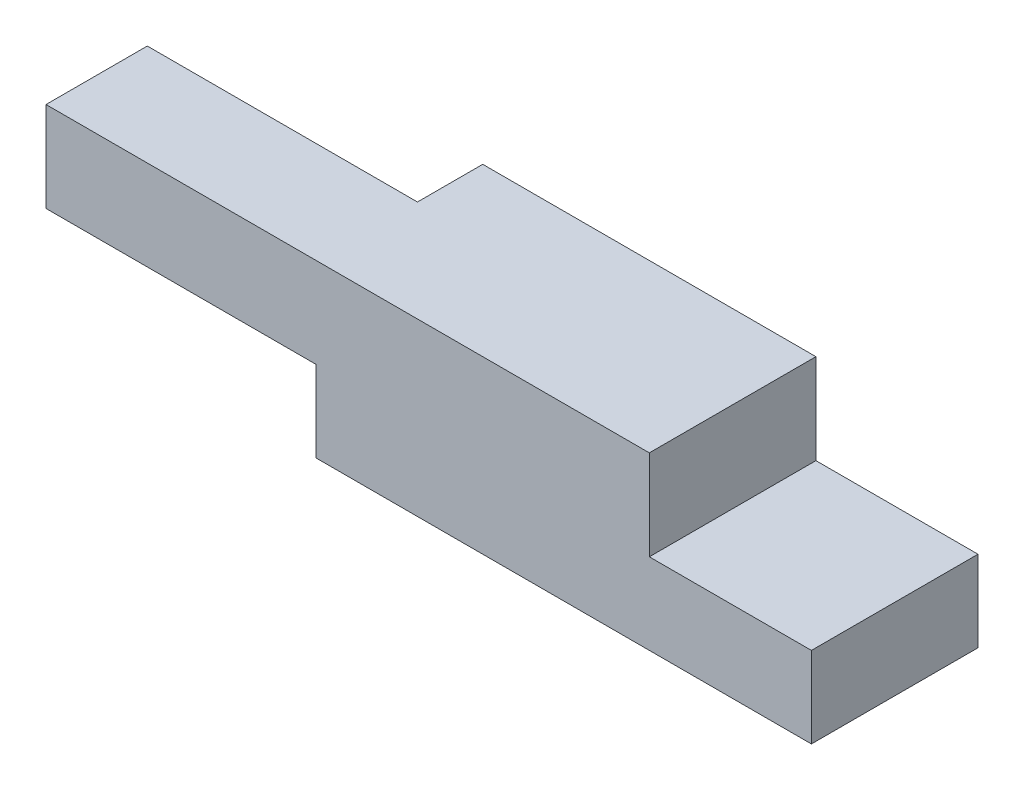
ISO-10303-21;
HEADER;
FILE_DESCRIPTION(('STEP AP214'),'2;1');
FILE_NAME('part.step','',(''),(''),'','','');
FILE_SCHEMA(('AUTOMOTIVE_DESIGN { 1 0 10303 214 1 1 1 1 }'));
ENDSEC;
DATA;
#1=APPLICATION_CONTEXT('core data for automotive mechanical design processes');
#2=APPLICATION_PROTOCOL_DEFINITION('international standard','automotive_design',2000,#1);
#3=PRODUCT_CONTEXT('',#1,'mechanical');
#4=PRODUCT('Part','Part','',(#3));
#5=PRODUCT_RELATED_PRODUCT_CATEGORY('part','',(#4));
#6=PRODUCT_DEFINITION_FORMATION('','',#4);
#7=PRODUCT_DEFINITION_CONTEXT('part definition',#1,'design');
#8=PRODUCT_DEFINITION('design','',#6,#7);
#9=PRODUCT_DEFINITION_SHAPE('','',#8);
#10=(LENGTH_UNIT() NAMED_UNIT(*) SI_UNIT(.MILLI.,.METRE.));
#11=(NAMED_UNIT(*) PLANE_ANGLE_UNIT() SI_UNIT($,.RADIAN.));
#12=(NAMED_UNIT(*) SI_UNIT($,.STERADIAN.) SOLID_ANGLE_UNIT());
#13=UNCERTAINTY_MEASURE_WITH_UNIT(LENGTH_MEASURE(1.E-05),#10,'distance_accuracy_value','');
#14=(GEOMETRIC_REPRESENTATION_CONTEXT(3) GLOBAL_UNCERTAINTY_ASSIGNED_CONTEXT((#13)) GLOBAL_UNIT_ASSIGNED_CONTEXT((#10,
#11,#12)) REPRESENTATION_CONTEXT('',''));
#15=CARTESIAN_POINT('',(0.,0.,0.));
#16=DIRECTION('',(0.,0.,1.));
#17=DIRECTION('',(1.,0.,0.));
#18=AXIS2_PLACEMENT_3D('',#15,#16,#17);
#19=CARTESIAN_POINT('',(-27.5,9.,-9.25));
#20=DIRECTION('',(1.,0.,0.));
#21=DIRECTION('',(0.,0.,-1.));
#22=AXIS2_PLACEMENT_3D('',#19,#20,#21);
#23=PLANE('',#22);
#24=DIRECTION('',(0.,0.,1.));
#25=VECTOR('',#24,1.);
#26=CARTESIAN_POINT('',(-27.5,9.,9.25));
#27=LINE('',#26,#25);
#28=CARTESIAN_POINT('',(-27.5,9.,2.00000000000001));
#29=VERTEX_POINT('',#28);
#30=CARTESIAN_POINT('',(-27.5,9.,9.25));
#31=VERTEX_POINT('',#30);
#32=EDGE_CURVE('E59',#29,#31,#27,.T.);
#33=ORIENTED_EDGE('',*,*,#32,.F.);
#34=DIRECTION('',(0.,1.,0.));
#35=VECTOR('',#34,1.);
#36=CARTESIAN_POINT('',(-27.5,0.,2.00000000000001));
#37=LINE('',#36,#35);
#38=CARTESIAN_POINT('',(-27.5,0.,2.00000000000001));
#39=VERTEX_POINT('',#38);
#40=EDGE_CURVE('E177',#39,#29,#37,.T.);
#41=ORIENTED_EDGE('',*,*,#40,.F.);
#42=DIRECTION('',(0.,0.,1.));
#43=VECTOR('',#42,1.);
#44=CARTESIAN_POINT('',(-27.5,0.,-9.25));
#45=LINE('',#44,#43);
#46=CARTESIAN_POINT('',(-27.5,0.,9.25));
#47=VERTEX_POINT('',#46);
#48=EDGE_CURVE('E239',#39,#47,#45,.T.);
#49=ORIENTED_EDGE('',*,*,#48,.T.);
#50=DIRECTION('',(0.,-1.,0.));
#51=VECTOR('',#50,1.);
#52=CARTESIAN_POINT('',(-27.5,9.,9.25));
#53=LINE('',#52,#51);
#54=EDGE_CURVE('E55',#31,#47,#53,.T.);
#55=ORIENTED_EDGE('',*,*,#54,.F.);
#56=EDGE_LOOP('',(#33,#41,#49,#55));
#57=FACE_BOUND('',#56,.T.);
#58=ADVANCED_FACE('F39',(#57),#23,.F.);
#59=CARTESIAN_POINT('',(-31.5,0.,2.00000000000001));
#60=DIRECTION('',(0.,0.,-1.));
#61=DIRECTION('',(-1.,0.,0.));
#62=AXIS2_PLACEMENT_3D('',#59,#60,#61);
#63=PLANE('',#62);
#64=DIRECTION('',(1.,0.,0.));
#65=VECTOR('',#64,1.);
#66=CARTESIAN_POINT('',(-31.5,9.,2.00000000000001));
#67=LINE('',#66,#65);
#68=CARTESIAN_POINT('',(-31.5,9.,2.00000000000001));
#69=VERTEX_POINT('',#68);
#70=EDGE_CURVE('E173',#69,#29,#67,.T.);
#71=ORIENTED_EDGE('',*,*,#70,.F.);
#72=DIRECTION('',(0.,1.,0.));
#73=VECTOR('',#72,1.);
#74=CARTESIAN_POINT('',(-31.5,0.,2.00000000000001));
#75=LINE('',#74,#73);
#76=CARTESIAN_POINT('',(-31.5,0.,2.00000000000001));
#77=VERTEX_POINT('',#76);
#78=EDGE_CURVE('E178',#77,#69,#75,.T.);
#79=ORIENTED_EDGE('',*,*,#78,.F.);
#80=DIRECTION('',(1.,0.,0.));
#81=VECTOR('',#80,1.);
#82=CARTESIAN_POINT('',(-31.5,0.,2.00000000000001));
#83=LINE('',#82,#81);
#84=EDGE_CURVE('E188',#77,#39,#83,.T.);
#85=ORIENTED_EDGE('',*,*,#84,.T.);
#86=ORIENTED_EDGE('',*,*,#40,.T.);
#87=EDGE_LOOP('',(#71,#79,#85,#86));
#88=FACE_BOUND('',#87,.T.);
#89=ADVANCED_FACE('F284',(#88),#63,.F.);
#90=CARTESIAN_POINT('',(-31.5,0.,0.));
#91=DIRECTION('',(1.,0.,0.));
#92=DIRECTION('',(0.,0.,-1.));
#93=AXIS2_PLACEMENT_3D('',#90,#91,#92);
#94=PLANE('',#93);
#95=DIRECTION('',(0.,0.,1.));
#96=VECTOR('',#95,1.);
#97=CARTESIAN_POINT('',(-31.5,9.,0.));
#98=LINE('',#97,#96);
#99=CARTESIAN_POINT('',(-31.5,9.,-1.99999999999999));
#100=VERTEX_POINT('',#99);
#101=EDGE_CURVE('E11',#100,#69,#98,.T.);
#102=ORIENTED_EDGE('',*,*,#101,.F.);
#103=DIRECTION('',(0.,-1.,0.));
#104=VECTOR('',#103,1.);
#105=CARTESIAN_POINT('',(-31.5,0.,-1.99999999999999));
#106=LINE('',#105,#104);
#107=CARTESIAN_POINT('',(-31.5,0.,-1.99999999999999));
#108=VERTEX_POINT('',#107);
#109=EDGE_CURVE('E181',#100,#108,#106,.T.);
#110=ORIENTED_EDGE('',*,*,#109,.T.);
#111=DIRECTION('',(0.,0.,1.));
#112=VECTOR('',#111,1.);
#113=CARTESIAN_POINT('',(-31.5,0.,-1.99999999999999));
#114=LINE('',#113,#112);
#115=EDGE_CURVE('E185',#108,#77,#114,.T.);
#116=ORIENTED_EDGE('',*,*,#115,.T.);
#117=ORIENTED_EDGE('',*,*,#78,.T.);
#118=EDGE_LOOP('',(#102,#110,#116,#117));
#119=FACE_BOUND('',#118,.T.);
#120=ADVANCED_FACE('F286',(#119),#94,.F.);
#121=DIRECTION('',(0.,-1.,0.));
#122=VECTOR('',#121,1.);
#123=CARTESIAN_POINT('',(-27.5,0.,-1.99999999999999));
#124=LINE('',#123,#122);
#125=CARTESIAN_POINT('',(-27.5,19.,-1.99999999999999));
#126=VERTEX_POINT('',#125);
#127=CARTESIAN_POINT('',(-27.5,0.,-1.99999999999999));
#128=VERTEX_POINT('',#127);
#129=EDGE_CURVE('E182',#126,#128,#124,.T.);
#130=ORIENTED_EDGE('',*,*,#129,.F.);
#131=DIRECTION('',(0.,0.,1.));
#132=VECTOR('',#131,1.);
#133=CARTESIAN_POINT('',(-27.5,19.,-9.25));
#134=LINE('',#133,#132);
#135=CARTESIAN_POINT('',(-27.5,19.,-9.25));
#136=VERTEX_POINT('',#135);
#137=EDGE_CURVE('E140',#136,#126,#134,.T.);
#138=ORIENTED_EDGE('',*,*,#137,.F.);
#139=DIRECTION('',(0.,-1.,0.));
#140=VECTOR('',#139,1.);
#141=CARTESIAN_POINT('',(-27.5,9.,-9.25));
#142=LINE('',#141,#140);
#143=CARTESIAN_POINT('',(-27.5,0.,-9.25));
#144=VERTEX_POINT('',#143);
#145=EDGE_CURVE('E251',#136,#144,#142,.T.);
#146=ORIENTED_EDGE('',*,*,#145,.T.);
#147=EDGE_CURVE('E240',#144,#128,#45,.T.);
#148=ORIENTED_EDGE('',*,*,#147,.T.);
#149=EDGE_LOOP('',(#130,#138,#146,#148));
#150=FACE_BOUND('',#149,.T.);
#151=ADVANCED_FACE('F271',(#150),#23,.F.);
#152=CARTESIAN_POINT('',(27.5,9.,-9.24999999999999));
#153=DIRECTION('',(-1.,0.,0.));
#154=DIRECTION('',(0.,0.,1.));
#155=AXIS2_PLACEMENT_3D('',#152,#153,#154);
#156=PLANE('',#155);
#157=DIRECTION('',(0.,0.,-1.));
#158=VECTOR('',#157,1.);
#159=CARTESIAN_POINT('',(27.5,0.,-9.24999999999999));
#160=LINE('',#159,#158);
#161=CARTESIAN_POINT('',(27.5,0.,9.25));
#162=VERTEX_POINT('',#161);
#163=CARTESIAN_POINT('',(27.5,0.,-9.24999999999999));
#164=VERTEX_POINT('',#163);
#165=EDGE_CURVE('E220',#162,#164,#160,.T.);
#166=ORIENTED_EDGE('',*,*,#165,.T.);
#167=DIRECTION('',(0.,-1.,0.));
#168=VECTOR('',#167,1.);
#169=CARTESIAN_POINT('',(27.5,9.,-9.24999999999999));
#170=LINE('',#169,#168);
#171=CARTESIAN_POINT('',(27.5,9.,-9.24999999999999));
#172=VERTEX_POINT('',#171);
#173=EDGE_CURVE('E48',#172,#164,#170,.T.);
#174=ORIENTED_EDGE('',*,*,#173,.F.);
#175=DIRECTION('',(0.,0.,-1.));
#176=VECTOR('',#175,1.);
#177=CARTESIAN_POINT('',(27.5,9.,-9.24999999999999));
#178=LINE('',#177,#176);
#179=CARTESIAN_POINT('',(27.5,9.,9.25));
#180=VERTEX_POINT('',#179);
#181=EDGE_CURVE('E221',#180,#172,#178,.T.);
#182=ORIENTED_EDGE('',*,*,#181,.F.);
#183=DIRECTION('',(0.,-1.,0.));
#184=VECTOR('',#183,1.);
#185=CARTESIAN_POINT('',(27.5,9.,9.25));
#186=LINE('',#185,#184);
#187=EDGE_CURVE('E232',#180,#162,#186,.T.);
#188=ORIENTED_EDGE('',*,*,#187,.T.);
#189=EDGE_LOOP('',(#166,#174,#182,#188));
#190=FACE_BOUND('',#189,.T.);
#191=ADVANCED_FACE('F41',(#190),#156,.F.);
#192=CARTESIAN_POINT('',(-27.5,9.,-9.25));
#193=DIRECTION('',(0.,0.,1.));
#194=DIRECTION('',(1.,0.,0.));
#195=AXIS2_PLACEMENT_3D('',#192,#193,#194);
#196=PLANE('',#195);
#197=DIRECTION('',(-1.,0.,0.));
#198=VECTOR('',#197,1.);
#199=CARTESIAN_POINT('',(-27.5,0.,-9.25));
#200=LINE('',#199,#198);
#201=EDGE_CURVE('E236',#164,#144,#200,.T.);
#202=ORIENTED_EDGE('',*,*,#201,.T.);
#203=ORIENTED_EDGE('',*,*,#145,.F.);
#204=DIRECTION('',(-1.,0.,0.));
#205=VECTOR('',#204,1.);
#206=CARTESIAN_POINT('',(-27.5,19.,-9.25));
#207=LINE('',#206,#205);
#208=CARTESIAN_POINT('',(9.5,19.,-9.25));
#209=VERTEX_POINT('',#208);
#210=EDGE_CURVE('E207',#209,#136,#207,.T.);
#211=ORIENTED_EDGE('',*,*,#210,.F.);
#212=DIRECTION('',(0.,-1.,0.));
#213=VECTOR('',#212,1.);
#214=CARTESIAN_POINT('',(9.5,19.,-9.25));
#215=LINE('',#214,#213);
#216=CARTESIAN_POINT('',(9.5,9.,-9.25));
#217=VERTEX_POINT('',#216);
#218=EDGE_CURVE('E211',#209,#217,#215,.T.);
#219=ORIENTED_EDGE('',*,*,#218,.T.);
#220=DIRECTION('',(-1.,0.,0.));
#221=VECTOR('',#220,1.);
#222=CARTESIAN_POINT('',(-27.5,9.,-9.25));
#223=LINE('',#222,#221);
#224=EDGE_CURVE('E225',#172,#217,#223,.T.);
#225=ORIENTED_EDGE('',*,*,#224,.F.);
#226=ORIENTED_EDGE('',*,*,#173,.T.);
#227=EDGE_LOOP('',(#202,#203,#211,#219,#225,#226));
#228=FACE_BOUND('',#227,.T.);
#229=ADVANCED_FACE('F258',(#228),#196,.F.);
#230=CARTESIAN_POINT('',(-27.5,9.,9.25));
#231=DIRECTION('',(0.,0.,-1.));
#232=DIRECTION('',(-1.,0.,0.));
#233=AXIS2_PLACEMENT_3D('',#230,#231,#232);
#234=PLANE('',#233);
#235=DIRECTION('',(1.,0.,0.));
#236=VECTOR('',#235,1.);
#237=CARTESIAN_POINT('',(-27.5,0.,9.25));
#238=LINE('',#237,#236);
#239=EDGE_CURVE('E226',#47,#162,#238,.T.);
#240=ORIENTED_EDGE('',*,*,#239,.T.);
#241=ORIENTED_EDGE('',*,*,#187,.F.);
#242=DIRECTION('',(1.,0.,0.));
#243=VECTOR('',#242,1.);
#244=CARTESIAN_POINT('',(-27.5,9.,9.25));
#245=LINE('',#244,#243);
#246=CARTESIAN_POINT('',(9.5,9.,9.25));
#247=VERTEX_POINT('',#246);
#248=EDGE_CURVE('E229',#247,#180,#245,.T.);
#249=ORIENTED_EDGE('',*,*,#248,.F.);
#250=DIRECTION('',(0.,-1.,0.));
#251=VECTOR('',#250,1.);
#252=CARTESIAN_POINT('',(9.5,19.,9.25));
#253=LINE('',#252,#251);
#254=CARTESIAN_POINT('',(9.5,19.,9.25));
#255=VERTEX_POINT('',#254);
#256=EDGE_CURVE('E135',#255,#247,#253,.T.);
#257=ORIENTED_EDGE('',*,*,#256,.F.);
#258=DIRECTION('',(1.,0.,0.));
#259=VECTOR('',#258,1.);
#260=CARTESIAN_POINT('',(-27.5,19.,9.25));
#261=LINE('',#260,#259);
#262=CARTESIAN_POINT('',(-57.5,19.,9.25000000000001));
#263=VERTEX_POINT('',#262);
#264=EDGE_CURVE('E127',#263,#255,#261,.T.);
#265=ORIENTED_EDGE('',*,*,#264,.F.);
#266=DIRECTION('',(0.,1.,0.));
#267=VECTOR('',#266,1.);
#268=CARTESIAN_POINT('',(-57.5,19.,9.25000000000001));
#269=LINE('',#268,#267);
#270=CARTESIAN_POINT('',(-57.5,9.,9.25000000000001));
#271=VERTEX_POINT('',#270);
#272=EDGE_CURVE('E132',#271,#263,#269,.T.);
#273=ORIENTED_EDGE('',*,*,#272,.F.);
#274=DIRECTION('',(1.,0.,0.));
#275=VECTOR('',#274,1.);
#276=CARTESIAN_POINT('',(-57.5,9.,9.25000000000001));
#277=LINE('',#276,#275);
#278=EDGE_CURVE('E165',#271,#31,#277,.T.);
#279=ORIENTED_EDGE('',*,*,#278,.T.);
#280=ORIENTED_EDGE('',*,*,#54,.T.);
#281=EDGE_LOOP('',(#240,#241,#249,#257,#265,#273,#279,#280));
#282=FACE_BOUND('',#281,.T.);
#283=ADVANCED_FACE('F129',(#282),#234,.F.);
#284=CARTESIAN_POINT('',(0.,9.,0.));
#285=DIRECTION('',(0.,1.,0.));
#286=DIRECTION('',(0.,0.,1.));
#287=AXIS2_PLACEMENT_3D('',#284,#285,#286);
#288=PLANE('',#287);
#289=DIRECTION('',(0.,0.,-1.));
#290=VECTOR('',#289,1.);
#291=CARTESIAN_POINT('',(9.5,9.,-9.25));
#292=LINE('',#291,#290);
#293=EDGE_CURVE('E202',#247,#217,#292,.T.);
#294=ORIENTED_EDGE('',*,*,#293,.F.);
#295=ORIENTED_EDGE('',*,*,#248,.T.);
#296=ORIENTED_EDGE('',*,*,#181,.T.);
#297=ORIENTED_EDGE('',*,*,#224,.T.);
#298=EDGE_LOOP('',(#294,#295,#296,#297));
#299=FACE_BOUND('',#298,.T.);
#300=ADVANCED_FACE('F278',(#299),#288,.T.);
#301=CARTESIAN_POINT('',(0.,0.,0.));
#302=DIRECTION('',(0.,1.,0.));
#303=DIRECTION('',(0.,0.,1.));
#304=AXIS2_PLACEMENT_3D('',#301,#302,#303);
#305=PLANE('',#304);
#306=ORIENTED_EDGE('',*,*,#165,.F.);
#307=ORIENTED_EDGE('',*,*,#239,.F.);
#308=ORIENTED_EDGE('',*,*,#48,.F.);
#309=ORIENTED_EDGE('',*,*,#84,.F.);
#310=ORIENTED_EDGE('',*,*,#115,.F.);
#311=DIRECTION('',(1.,0.,0.));
#312=VECTOR('',#311,1.);
#313=CARTESIAN_POINT('',(-31.5,0.,-1.99999999999999));
#314=LINE('',#313,#312);
#315=EDGE_CURVE('E196',#108,#128,#314,.T.);
#316=ORIENTED_EDGE('',*,*,#315,.T.);
#317=ORIENTED_EDGE('',*,*,#147,.F.);
#318=ORIENTED_EDGE('',*,*,#201,.F.);
#319=EDGE_LOOP('',(#306,#307,#308,#309,#310,#316,#317,#318));
#320=FACE_BOUND('',#319,.T.);
#321=ADVANCED_FACE('F265',(#320),#305,.F.);
#322=CARTESIAN_POINT('',(9.5,19.,-9.25));
#323=DIRECTION('',(-1.,0.,0.));
#324=DIRECTION('',(0.,0.,1.));
#325=AXIS2_PLACEMENT_3D('',#322,#323,#324);
#326=PLANE('',#325);
#327=ORIENTED_EDGE('',*,*,#293,.T.);
#328=ORIENTED_EDGE('',*,*,#218,.F.);
#329=DIRECTION('',(0.,0.,-1.));
#330=VECTOR('',#329,1.);
#331=CARTESIAN_POINT('',(9.5,19.,-9.25));
#332=LINE('',#331,#330);
#333=EDGE_CURVE('E139',#255,#209,#332,.T.);
#334=ORIENTED_EDGE('',*,*,#333,.F.);
#335=ORIENTED_EDGE('',*,*,#256,.T.);
#336=EDGE_LOOP('',(#327,#328,#334,#335));
#337=FACE_BOUND('',#336,.T.);
#338=ADVANCED_FACE('F276',(#337),#326,.F.);
#339=CARTESIAN_POINT('',(0.,19.,0.));
#340=DIRECTION('',(0.,1.,0.));
#341=DIRECTION('',(0.,0.,1.));
#342=AXIS2_PLACEMENT_3D('',#339,#340,#341);
#343=PLANE('',#342);
#344=DIRECTION('',(0.,0.,-1.));
#345=VECTOR('',#344,1.);
#346=CARTESIAN_POINT('',(-57.5,19.,9.25000000000001));
#347=LINE('',#346,#345);
#348=CARTESIAN_POINT('',(-57.5,19.,-1.99999999999998));
#349=VERTEX_POINT('',#348);
#350=EDGE_CURVE('E143',#263,#349,#347,.T.);
#351=ORIENTED_EDGE('',*,*,#350,.F.);
#352=ORIENTED_EDGE('',*,*,#264,.T.);
#353=ORIENTED_EDGE('',*,*,#333,.T.);
#354=ORIENTED_EDGE('',*,*,#210,.T.);
#355=ORIENTED_EDGE('',*,*,#137,.T.);
#356=DIRECTION('',(1.,0.,0.));
#357=VECTOR('',#356,1.);
#358=CARTESIAN_POINT('',(-31.5,19.,-1.99999999999999));
#359=LINE('',#358,#357);
#360=EDGE_CURVE('E147',#349,#126,#359,.T.);
#361=ORIENTED_EDGE('',*,*,#360,.F.);
#362=EDGE_LOOP('',(#351,#352,#353,#354,#355,#361));
#363=FACE_BOUND('',#362,.T.);
#364=ADVANCED_FACE('F144',(#363),#343,.T.);
#365=CARTESIAN_POINT('',(-31.5,0.,-1.99999999999999));
#366=DIRECTION('',(0.,0.,1.));
#367=DIRECTION('',(1.,0.,0.));
#368=AXIS2_PLACEMENT_3D('',#365,#366,#367);
#369=PLANE('',#368);
#370=ORIENTED_EDGE('',*,*,#129,.T.);
#371=ORIENTED_EDGE('',*,*,#315,.F.);
#372=ORIENTED_EDGE('',*,*,#109,.F.);
#373=DIRECTION('',(1.,0.,0.));
#374=VECTOR('',#373,1.);
#375=CARTESIAN_POINT('',(-57.5,9.,-1.99999999999998));
#376=LINE('',#375,#374);
#377=CARTESIAN_POINT('',(-57.5,9.,-1.99999999999998));
#378=VERTEX_POINT('',#377);
#379=EDGE_CURVE('E169',#378,#100,#376,.T.);
#380=ORIENTED_EDGE('',*,*,#379,.F.);
#381=DIRECTION('',(0.,-1.,0.));
#382=VECTOR('',#381,1.);
#383=CARTESIAN_POINT('',(-57.5,19.,-1.99999999999998));
#384=LINE('',#383,#382);
#385=EDGE_CURVE('E151',#349,#378,#384,.T.);
#386=ORIENTED_EDGE('',*,*,#385,.F.);
#387=ORIENTED_EDGE('',*,*,#360,.T.);
#388=EDGE_LOOP('',(#370,#371,#372,#380,#386,#387));
#389=FACE_BOUND('',#388,.T.);
#390=ADVANCED_FACE('F290',(#389),#369,.F.);
#391=CARTESIAN_POINT('',(-57.5,9.,9.25000000000001));
#392=DIRECTION('',(0.,1.,0.));
#393=DIRECTION('',(0.,0.,1.));
#394=AXIS2_PLACEMENT_3D('',#391,#392,#393);
#395=PLANE('',#394);
#396=ORIENTED_EDGE('',*,*,#101,.T.);
#397=ORIENTED_EDGE('',*,*,#70,.T.);
#398=ORIENTED_EDGE('',*,*,#32,.T.);
#399=ORIENTED_EDGE('',*,*,#278,.F.);
#400=DIRECTION('',(0.,0.,1.));
#401=VECTOR('',#400,1.);
#402=CARTESIAN_POINT('',(-57.5,9.,9.25000000000001));
#403=LINE('',#402,#401);
#404=EDGE_CURVE('E155',#378,#271,#403,.T.);
#405=ORIENTED_EDGE('',*,*,#404,.F.);
#406=ORIENTED_EDGE('',*,*,#379,.T.);
#407=EDGE_LOOP('',(#396,#397,#398,#399,#405,#406));
#408=FACE_BOUND('',#407,.T.);
#409=ADVANCED_FACE('F292',(#408),#395,.F.);
#410=CARTESIAN_POINT('',(-57.5,0.,0.));
#411=DIRECTION('',(1.,0.,0.));
#412=DIRECTION('',(0.,0.,-1.));
#413=AXIS2_PLACEMENT_3D('',#410,#411,#412);
#414=PLANE('',#413);
#415=ORIENTED_EDGE('',*,*,#272,.T.);
#416=ORIENTED_EDGE('',*,*,#350,.T.);
#417=ORIENTED_EDGE('',*,*,#385,.T.);
#418=ORIENTED_EDGE('',*,*,#404,.T.);
#419=EDGE_LOOP('',(#415,#416,#417,#418));
#420=FACE_BOUND('',#419,.T.);
#421=ADVANCED_FACE('F153',(#420),#414,.F.);
#422=CLOSED_SHELL('',(#58,#89,#120,#151,#191,#229,#283,#300,#321,#338,#364,#390,#409,#421));
#423=MANIFOLD_SOLID_BREP('B2',#422);
#424=ADVANCED_BREP_SHAPE_REPRESENTATION('',(#18,#423),#14);
#425=SHAPE_DEFINITION_REPRESENTATION(#9,#424);
ENDSEC;
END-ISO-10303-21;
